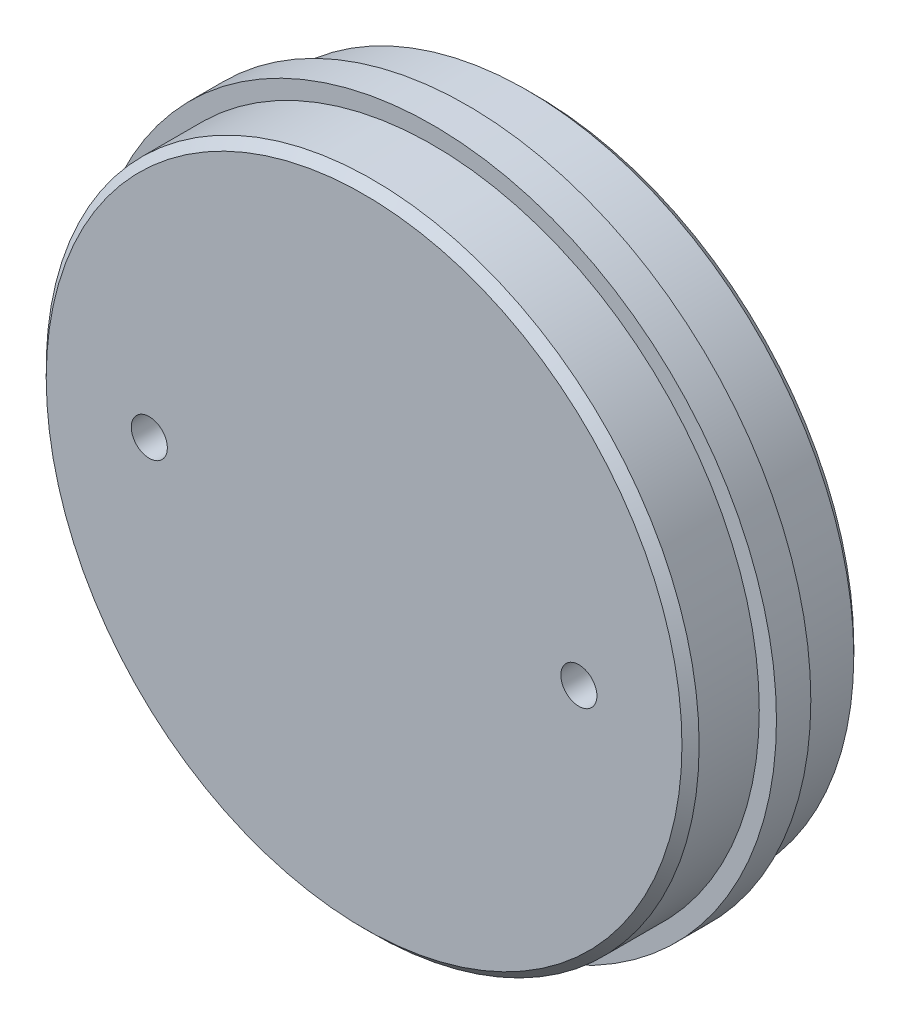
ISO-10303-21;
HEADER;
FILE_DESCRIPTION(('STEP AP214'),'2;1');
FILE_NAME('part.step','',(''),(''),'','','');
FILE_SCHEMA(('AUTOMOTIVE_DESIGN { 1 0 10303 214 1 1 1 1 }'));
ENDSEC;
DATA;
#1=APPLICATION_CONTEXT('core data for automotive mechanical design processes');
#2=APPLICATION_PROTOCOL_DEFINITION('international standard','automotive_design',2000,#1);
#3=PRODUCT_CONTEXT('',#1,'mechanical');
#4=PRODUCT('Part','Part','',(#3));
#5=PRODUCT_RELATED_PRODUCT_CATEGORY('part','',(#4));
#6=PRODUCT_DEFINITION_FORMATION('','',#4);
#7=PRODUCT_DEFINITION_CONTEXT('part definition',#1,'design');
#8=PRODUCT_DEFINITION('design','',#6,#7);
#9=PRODUCT_DEFINITION_SHAPE('','',#8);
#10=(LENGTH_UNIT() NAMED_UNIT(*) SI_UNIT(.MILLI.,.METRE.));
#11=(NAMED_UNIT(*) PLANE_ANGLE_UNIT() SI_UNIT($,.RADIAN.));
#12=(NAMED_UNIT(*) SI_UNIT($,.STERADIAN.) SOLID_ANGLE_UNIT());
#13=UNCERTAINTY_MEASURE_WITH_UNIT(LENGTH_MEASURE(1.E-05),#10,'distance_accuracy_value','');
#14=(GEOMETRIC_REPRESENTATION_CONTEXT(3) GLOBAL_UNCERTAINTY_ASSIGNED_CONTEXT((#13)) GLOBAL_UNIT_ASSIGNED_CONTEXT((#10,
#11,#12)) REPRESENTATION_CONTEXT('',''));
#15=CARTESIAN_POINT('',(0.,0.,0.));
#16=DIRECTION('',(0.,0.,1.));
#17=DIRECTION('',(1.,0.,0.));
#18=AXIS2_PLACEMENT_3D('',#15,#16,#17);
#19=CARTESIAN_POINT('',(0.,0.,4.));
#20=DIRECTION('',(0.,0.,-1.));
#21=DIRECTION('',(-1.,0.,0.));
#22=AXIS2_PLACEMENT_3D('',#19,#20,#21);
#23=CYLINDRICAL_SURFACE('',#22,40.);
#24=CARTESIAN_POINT('',(0.,0.,4.));
#25=DIRECTION('',(0.,0.,1.));
#26=DIRECTION('',(1.,0.,0.));
#27=AXIS2_PLACEMENT_3D('',#24,#25,#26);
#28=CIRCLE('',#27,40.);
#29=CARTESIAN_POINT('',(40.,0.,4.));
#30=VERTEX_POINT('',#29);
#31=EDGE_CURVE('E59',#30,#30,#28,.T.);
#32=ORIENTED_EDGE('',*,*,#31,.F.);
#33=EDGE_LOOP('',(#32));
#34=FACE_BOUND('',#33,.T.);
#35=CARTESIAN_POINT('',(0.,0.,0.));
#36=DIRECTION('',(0.,0.,1.));
#37=DIRECTION('',(1.,0.,0.));
#38=AXIS2_PLACEMENT_3D('',#35,#36,#37);
#39=CIRCLE('',#38,40.);
#40=CARTESIAN_POINT('',(40.,0.,0.));
#41=VERTEX_POINT('',#40);
#42=EDGE_CURVE('E55',#41,#41,#39,.T.);
#43=ORIENTED_EDGE('',*,*,#42,.T.);
#44=EDGE_LOOP('',(#43));
#45=FACE_BOUND('',#44,.T.);
#46=ADVANCED_FACE('F31',(#34,#45),#23,.T.);
#47=CARTESIAN_POINT('',(0.,0.,4.));
#48=DIRECTION('',(0.,0.,1.));
#49=DIRECTION('',(1.,0.,0.));
#50=AXIS2_PLACEMENT_3D('',#47,#48,#49);
#51=PLANE('',#50);
#52=CARTESIAN_POINT('',(0.,0.,4.));
#53=DIRECTION('',(0.,0.,1.));
#54=DIRECTION('',(1.,0.,0.));
#55=AXIS2_PLACEMENT_3D('',#52,#53,#54);
#56=CIRCLE('',#55,38.);
#57=CARTESIAN_POINT('',(38.,0.,4.));
#58=VERTEX_POINT('',#57);
#59=EDGE_CURVE('E51',#58,#58,#56,.T.);
#60=ORIENTED_EDGE('',*,*,#59,.F.);
#61=EDGE_LOOP('',(#60));
#62=FACE_BOUND('',#61,.T.);
#63=ORIENTED_EDGE('',*,*,#31,.T.);
#64=EDGE_LOOP('',(#63));
#65=FACE_BOUND('',#64,.T.);
#66=ADVANCED_FACE('F103',(#62,#65),#51,.T.);
#67=CARTESIAN_POINT('',(0.,0.,0.));
#68=DIRECTION('',(0.,0.,1.));
#69=DIRECTION('',(1.,0.,0.));
#70=AXIS2_PLACEMENT_3D('',#67,#68,#69);
#71=PLANE('',#70);
#72=CARTESIAN_POINT('',(0.,0.,0.));
#73=DIRECTION('',(0.,0.,1.));
#74=DIRECTION('',(1.,0.,0.));
#75=AXIS2_PLACEMENT_3D('',#72,#73,#74);
#76=CIRCLE('',#75,38.);
#77=CARTESIAN_POINT('',(38.,0.,0.));
#78=VERTEX_POINT('',#77);
#79=EDGE_CURVE('E52',#78,#78,#76,.T.);
#80=ORIENTED_EDGE('',*,*,#79,.T.);
#81=EDGE_LOOP('',(#80));
#82=FACE_BOUND('',#81,.T.);
#83=ORIENTED_EDGE('',*,*,#42,.F.);
#84=EDGE_LOOP('',(#83));
#85=FACE_BOUND('',#84,.T.);
#86=ADVANCED_FACE('F109',(#82,#85),#71,.F.);
#87=CARTESIAN_POINT('',(0.,0.,-8.));
#88=DIRECTION('',(0.,0.,1.));
#89=DIRECTION('',(1.,0.,0.));
#90=AXIS2_PLACEMENT_3D('',#87,#88,#89);
#91=PLANE('',#90);
#92=CARTESIAN_POINT('',(-25.,0.,-8.));
#93=DIRECTION('',(0.,0.,1.));
#94=DIRECTION('',(1.,0.,0.));
#95=AXIS2_PLACEMENT_3D('',#92,#93,#94);
#96=CIRCLE('',#95,2.1);
#97=CARTESIAN_POINT('',(-22.9,0.,-8.));
#98=VERTEX_POINT('',#97);
#99=EDGE_CURVE('E67',#98,#98,#96,.T.);
#100=ORIENTED_EDGE('',*,*,#99,.T.);
#101=EDGE_LOOP('',(#100));
#102=FACE_BOUND('',#101,.T.);
#103=CARTESIAN_POINT('',(25.,0.,-8.));
#104=DIRECTION('',(0.,0.,1.));
#105=DIRECTION('',(1.,0.,0.));
#106=AXIS2_PLACEMENT_3D('',#103,#104,#105);
#107=CIRCLE('',#106,2.1);
#108=CARTESIAN_POINT('',(27.1,0.,-8.));
#109=VERTEX_POINT('',#108);
#110=EDGE_CURVE('E56',#109,#109,#107,.T.);
#111=ORIENTED_EDGE('',*,*,#110,.T.);
#112=EDGE_LOOP('',(#111));
#113=FACE_BOUND('',#112,.T.);
#114=CARTESIAN_POINT('',(0.,0.,-8.));
#115=DIRECTION('',(0.,0.,1.));
#116=DIRECTION('',(1.,0.,0.));
#117=AXIS2_PLACEMENT_3D('',#114,#115,#116);
#118=CIRCLE('',#117,37.);
#119=CARTESIAN_POINT('',(37.,0.,-8.));
#120=VERTEX_POINT('',#119);
#121=EDGE_CURVE('E42',#120,#120,#118,.F.);
#122=ORIENTED_EDGE('',*,*,#121,.T.);
#123=EDGE_LOOP('',(#122));
#124=FACE_BOUND('',#123,.T.);
#125=ADVANCED_FACE('F76',(#102,#113,#124),#91,.F.);
#126=CARTESIAN_POINT('',(0.,0.,-8.));
#127=DIRECTION('',(0.,0.,1.));
#128=DIRECTION('',(1.,0.,0.));
#129=AXIS2_PLACEMENT_3D('',#126,#127,#128);
#130=CYLINDRICAL_SURFACE('',#129,38.);
#131=CARTESIAN_POINT('',(0.,0.,-7.));
#132=DIRECTION('',(0.,0.,1.));
#133=DIRECTION('',(1.,0.,0.));
#134=AXIS2_PLACEMENT_3D('',#131,#132,#133);
#135=CIRCLE('',#134,38.);
#136=CARTESIAN_POINT('',(38.,0.,-7.));
#137=VERTEX_POINT('',#136);
#138=EDGE_CURVE('E46',#137,#137,#135,.T.);
#139=ORIENTED_EDGE('',*,*,#138,.T.);
#140=EDGE_LOOP('',(#139));
#141=FACE_BOUND('',#140,.T.);
#142=ORIENTED_EDGE('',*,*,#79,.F.);
#143=EDGE_LOOP('',(#142));
#144=FACE_BOUND('',#143,.T.);
#145=ADVANCED_FACE('F123',(#141,#144),#130,.T.);
#146=CARTESIAN_POINT('',(0.,0.,11.));
#147=DIRECTION('',(0.,0.,1.));
#148=DIRECTION('',(1.,0.,0.));
#149=AXIS2_PLACEMENT_3D('',#146,#147,#148);
#150=CIRCLE('',#149,38.);
#151=CARTESIAN_POINT('',(38.,0.,11.));
#152=VERTEX_POINT('',#151);
#153=EDGE_CURVE('E10',#152,#152,#150,.F.);
#154=ORIENTED_EDGE('',*,*,#153,.T.);
#155=EDGE_LOOP('',(#154));
#156=FACE_BOUND('',#155,.T.);
#157=ORIENTED_EDGE('',*,*,#59,.T.);
#158=EDGE_LOOP('',(#157));
#159=FACE_BOUND('',#158,.T.);
#160=ADVANCED_FACE('F90',(#156,#159),#130,.T.);
#161=CARTESIAN_POINT('',(0.,0.,12.));
#162=DIRECTION('',(0.,0.,1.));
#163=DIRECTION('',(1.,0.,0.));
#164=AXIS2_PLACEMENT_3D('',#161,#162,#163);
#165=PLANE('',#164);
#166=CARTESIAN_POINT('',(-25.,0.,12.));
#167=DIRECTION('',(0.,0.,1.));
#168=DIRECTION('',(1.,0.,0.));
#169=AXIS2_PLACEMENT_3D('',#166,#167,#168);
#170=CIRCLE('',#169,2.1);
#171=CARTESIAN_POINT('',(-22.9,0.,12.));
#172=VERTEX_POINT('',#171);
#173=EDGE_CURVE('E70',#172,#172,#170,.T.);
#174=ORIENTED_EDGE('',*,*,#173,.F.);
#175=EDGE_LOOP('',(#174));
#176=FACE_BOUND('',#175,.T.);
#177=CARTESIAN_POINT('',(25.,0.,12.));
#178=DIRECTION('',(0.,0.,1.));
#179=DIRECTION('',(1.,0.,0.));
#180=AXIS2_PLACEMENT_3D('',#177,#178,#179);
#181=CIRCLE('',#180,2.1);
#182=CARTESIAN_POINT('',(27.1,0.,12.));
#183=VERTEX_POINT('',#182);
#184=EDGE_CURVE('E64',#183,#183,#181,.T.);
#185=ORIENTED_EDGE('',*,*,#184,.F.);
#186=EDGE_LOOP('',(#185));
#187=FACE_BOUND('',#186,.T.);
#188=CARTESIAN_POINT('',(0.,0.,12.));
#189=DIRECTION('',(0.,0.,1.));
#190=DIRECTION('',(1.,0.,0.));
#191=AXIS2_PLACEMENT_3D('',#188,#189,#190);
#192=CIRCLE('',#191,37.);
#193=CARTESIAN_POINT('',(37.,0.,12.));
#194=VERTEX_POINT('',#193);
#195=EDGE_CURVE('E38',#194,#194,#192,.T.);
#196=ORIENTED_EDGE('',*,*,#195,.T.);
#197=EDGE_LOOP('',(#196));
#198=FACE_BOUND('',#197,.T.);
#199=ADVANCED_FACE('F86',(#176,#187,#198),#165,.T.);
#200=CARTESIAN_POINT('',(0.,0.,-7.));
#201=DIRECTION('',(0.,0.,1.));
#202=DIRECTION('',(1.,0.,0.));
#203=AXIS2_PLACEMENT_3D('',#200,#201,#202);
#204=CONICAL_SURFACE('',#203,38.,0.785398163397452);
#205=ORIENTED_EDGE('',*,*,#121,.F.);
#206=EDGE_LOOP('',(#205));
#207=FACE_BOUND('',#206,.T.);
#208=ORIENTED_EDGE('',*,*,#138,.F.);
#209=EDGE_LOOP('',(#208));
#210=FACE_BOUND('',#209,.T.);
#211=ADVANCED_FACE('F89',(#207,#210),#204,.T.);
#212=CARTESIAN_POINT('',(0.,0.,12.));
#213=DIRECTION('',(0.,0.,-1.));
#214=DIRECTION('',(-1.,0.,0.));
#215=AXIS2_PLACEMENT_3D('',#212,#213,#214);
#216=CONICAL_SURFACE('',#215,37.,0.785398163397441);
#217=ORIENTED_EDGE('',*,*,#153,.F.);
#218=EDGE_LOOP('',(#217));
#219=FACE_BOUND('',#218,.T.);
#220=ORIENTED_EDGE('',*,*,#195,.F.);
#221=EDGE_LOOP('',(#220));
#222=FACE_BOUND('',#221,.T.);
#223=ADVANCED_FACE('F33',(#219,#222),#216,.T.);
#224=CARTESIAN_POINT('',(25.,0.,-8.));
#225=DIRECTION('',(0.,0.,1.));
#226=DIRECTION('',(1.,0.,0.));
#227=AXIS2_PLACEMENT_3D('',#224,#225,#226);
#228=CYLINDRICAL_SURFACE('',#227,2.1);
#229=ORIENTED_EDGE('',*,*,#110,.F.);
#230=EDGE_LOOP('',(#229));
#231=FACE_BOUND('',#230,.T.);
#232=ORIENTED_EDGE('',*,*,#184,.T.);
#233=EDGE_LOOP('',(#232));
#234=FACE_BOUND('',#233,.T.);
#235=ADVANCED_FACE('F82',(#231,#234),#228,.F.);
#236=CARTESIAN_POINT('',(-25.,0.,-8.));
#237=DIRECTION('',(0.,0.,1.));
#238=DIRECTION('',(1.,0.,0.));
#239=AXIS2_PLACEMENT_3D('',#236,#237,#238);
#240=CYLINDRICAL_SURFACE('',#239,2.1);
#241=ORIENTED_EDGE('',*,*,#99,.F.);
#242=EDGE_LOOP('',(#241));
#243=FACE_BOUND('',#242,.T.);
#244=ORIENTED_EDGE('',*,*,#173,.T.);
#245=EDGE_LOOP('',(#244));
#246=FACE_BOUND('',#245,.T.);
#247=ADVANCED_FACE('F79',(#243,#246),#240,.F.);
#248=CLOSED_SHELL('',(#46,#66,#86,#125,#145,#160,#199,#211,#223,#235,#247));
#249=MANIFOLD_SOLID_BREP('B2',#248);
#250=ADVANCED_BREP_SHAPE_REPRESENTATION('',(#18,#249),#14);
#251=SHAPE_DEFINITION_REPRESENTATION(#9,#250);
ENDSEC;
END-ISO-10303-21;
